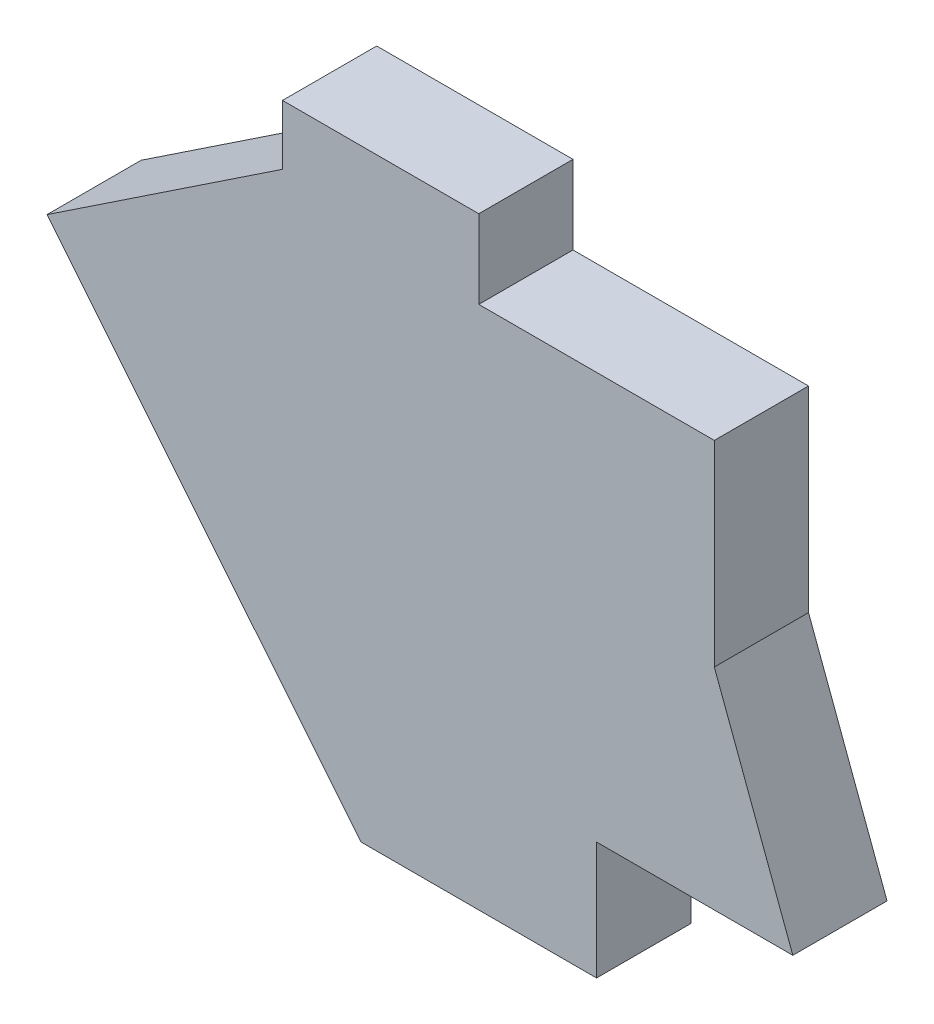
ISO-10303-21;
HEADER;
FILE_DESCRIPTION(('STEP AP214'),'2;1');
FILE_NAME('part.step','',(''),(''),'','','');
FILE_SCHEMA(('AUTOMOTIVE_DESIGN { 1 0 10303 214 1 1 1 1 }'));
ENDSEC;
DATA;
#1=APPLICATION_CONTEXT('core data for automotive mechanical design processes');
#2=APPLICATION_PROTOCOL_DEFINITION('international standard','automotive_design',2000,#1);
#3=PRODUCT_CONTEXT('',#1,'mechanical');
#4=PRODUCT('Part','Part','',(#3));
#5=PRODUCT_RELATED_PRODUCT_CATEGORY('part','',(#4));
#6=PRODUCT_DEFINITION_FORMATION('','',#4);
#7=PRODUCT_DEFINITION_CONTEXT('part definition',#1,'design');
#8=PRODUCT_DEFINITION('design','',#6,#7);
#9=PRODUCT_DEFINITION_SHAPE('','',#8);
#10=(LENGTH_UNIT() NAMED_UNIT(*) SI_UNIT(.MILLI.,.METRE.));
#11=(NAMED_UNIT(*) PLANE_ANGLE_UNIT() SI_UNIT($,.RADIAN.));
#12=(NAMED_UNIT(*) SI_UNIT($,.STERADIAN.) SOLID_ANGLE_UNIT());
#13=UNCERTAINTY_MEASURE_WITH_UNIT(LENGTH_MEASURE(1.E-05),#10,'distance_accuracy_value','');
#14=(GEOMETRIC_REPRESENTATION_CONTEXT(3) GLOBAL_UNCERTAINTY_ASSIGNED_CONTEXT((#13)) GLOBAL_UNIT_ASSIGNED_CONTEXT((#10,
#11,#12)) REPRESENTATION_CONTEXT('',''));
#15=CARTESIAN_POINT('',(0.,0.,0.));
#16=DIRECTION('',(0.,0.,1.));
#17=DIRECTION('',(1.,0.,0.));
#18=AXIS2_PLACEMENT_3D('',#15,#16,#17);
#19=CARTESIAN_POINT('',(-69.85,2.21879492064849,15.24));
#20=DIRECTION('',(0.554700196225229,-0.832050294337843,0.));
#21=DIRECTION('',(0.832050294337844,0.554700196225229,0.));
#22=AXIS2_PLACEMENT_3D('',#19,#20,#21);
#23=PLANE('',#22);
#24=DIRECTION('',(-0.832050294337844,-0.554700196225229,0.));
#25=VECTOR('',#24,1.);
#26=CARTESIAN_POINT('',(-69.85,2.21879492064849,0.));
#27=LINE('',#26,#25);
#28=CARTESIAN_POINT('',(-31.75,27.6187949206485,0.));
#29=VERTEX_POINT('',#28);
#30=CARTESIAN_POINT('',(-69.85,2.21879492064849,0.));
#31=VERTEX_POINT('',#30);
#32=EDGE_CURVE('E158',#29,#31,#27,.T.);
#33=ORIENTED_EDGE('',*,*,#32,.T.);
#34=DIRECTION('',(0.,0.,-1.));
#35=VECTOR('',#34,1.);
#36=CARTESIAN_POINT('',(-69.85,2.21879492064849,15.24));
#37=LINE('',#36,#35);
#38=CARTESIAN_POINT('',(-69.85,2.21879492064849,15.24));
#39=VERTEX_POINT('',#38);
#40=EDGE_CURVE('E11',#39,#31,#37,.T.);
#41=ORIENTED_EDGE('',*,*,#40,.F.);
#42=DIRECTION('',(-0.832050294337844,-0.554700196225229,0.));
#43=VECTOR('',#42,1.);
#44=CARTESIAN_POINT('',(-69.85,2.21879492064849,15.24));
#45=LINE('',#44,#43);
#46=CARTESIAN_POINT('',(-31.75,27.6187949206485,15.24));
#47=VERTEX_POINT('',#46);
#48=EDGE_CURVE('E189',#47,#39,#45,.T.);
#49=ORIENTED_EDGE('',*,*,#48,.F.);
#50=DIRECTION('',(0.,0.,-1.));
#51=VECTOR('',#50,1.);
#52=CARTESIAN_POINT('',(-31.75,27.6187949206485,15.24));
#53=LINE('',#52,#51);
#54=EDGE_CURVE('E154',#47,#29,#53,.T.);
#55=ORIENTED_EDGE('',*,*,#54,.T.);
#56=EDGE_LOOP('',(#33,#41,#49,#55));
#57=FACE_BOUND('',#56,.T.);
#58=ADVANCED_FACE('F39',(#57),#23,.F.);
#59=CARTESIAN_POINT('',(-19.0499999999999,-60.2652050793515,15.24));
#60=DIRECTION('',(0.775921003990177,0.630830084544861,0.));
#61=DIRECTION('',(-0.630830084544861,0.775921003990177,0.));
#62=AXIS2_PLACEMENT_3D('',#59,#60,#61);
#63=PLANE('',#62);
#64=DIRECTION('',(0.630830084544861,-0.775921003990177,0.));
#65=VECTOR('',#64,1.);
#66=CARTESIAN_POINT('',(-19.0499999999999,-60.2652050793515,0.));
#67=LINE('',#66,#65);
#68=CARTESIAN_POINT('',(-19.0499999999999,-60.2652050793515,0.));
#69=VERTEX_POINT('',#68);
#70=EDGE_CURVE('E162',#31,#69,#67,.T.);
#71=ORIENTED_EDGE('',*,*,#70,.T.);
#72=DIRECTION('',(0.,0.,-1.));
#73=VECTOR('',#72,1.);
#74=CARTESIAN_POINT('',(-19.0499999999999,-60.2652050793515,15.24));
#75=LINE('',#74,#73);
#76=CARTESIAN_POINT('',(-19.0499999999999,-60.2652050793515,15.24));
#77=VERTEX_POINT('',#76);
#78=EDGE_CURVE('E48',#77,#69,#75,.T.);
#79=ORIENTED_EDGE('',*,*,#78,.F.);
#80=DIRECTION('',(0.630830084544861,-0.775921003990177,0.));
#81=VECTOR('',#80,1.);
#82=CARTESIAN_POINT('',(-19.0499999999999,-60.2652050793515,15.24));
#83=LINE('',#82,#81);
#84=EDGE_CURVE('E108',#39,#77,#83,.T.);
#85=ORIENTED_EDGE('',*,*,#84,.F.);
#86=ORIENTED_EDGE('',*,*,#40,.T.);
#87=EDGE_LOOP('',(#71,#79,#85,#86));
#88=FACE_BOUND('',#87,.T.);
#89=ADVANCED_FACE('F275',(#88),#63,.F.);
#90=CARTESIAN_POINT('',(19.0500000000001,-60.2652050793515,15.24));
#91=DIRECTION('',(0.,1.,0.));
#92=DIRECTION('',(-1.,0.,0.));
#93=AXIS2_PLACEMENT_3D('',#90,#91,#92);
#94=PLANE('',#93);
#95=DIRECTION('',(1.,0.,0.));
#96=VECTOR('',#95,1.);
#97=CARTESIAN_POINT('',(19.0500000000001,-60.2652050793515,0.));
#98=LINE('',#97,#96);
#99=CARTESIAN_POINT('',(19.0500000000001,-60.2652050793515,0.));
#100=VERTEX_POINT('',#99);
#101=EDGE_CURVE('E165',#69,#100,#98,.T.);
#102=ORIENTED_EDGE('',*,*,#101,.T.);
#103=DIRECTION('',(0.,0.,-1.));
#104=VECTOR('',#103,1.);
#105=CARTESIAN_POINT('',(19.0500000000001,-60.2652050793515,15.24));
#106=LINE('',#105,#104);
#107=CARTESIAN_POINT('',(19.0500000000001,-60.2652050793515,15.24));
#108=VERTEX_POINT('',#107);
#109=EDGE_CURVE('E212',#108,#100,#106,.T.);
#110=ORIENTED_EDGE('',*,*,#109,.F.);
#111=DIRECTION('',(1.,0.,0.));
#112=VECTOR('',#111,1.);
#113=CARTESIAN_POINT('',(19.0500000000001,-60.2652050793515,15.24));
#114=LINE('',#113,#112);
#115=EDGE_CURVE('E222',#77,#108,#114,.T.);
#116=ORIENTED_EDGE('',*,*,#115,.F.);
#117=ORIENTED_EDGE('',*,*,#78,.T.);
#118=EDGE_LOOP('',(#102,#110,#116,#117));
#119=FACE_BOUND('',#118,.T.);
#120=ADVANCED_FACE('F220',(#119),#94,.F.);
#121=CARTESIAN_POINT('',(19.0500000000001,-41.2152050793515,15.24));
#122=DIRECTION('',(-1.,0.,0.));
#123=DIRECTION('',(0.,0.,1.));
#124=AXIS2_PLACEMENT_3D('',#121,#122,#123);
#125=PLANE('',#124);
#126=DIRECTION('',(0.,1.,0.));
#127=VECTOR('',#126,1.);
#128=CARTESIAN_POINT('',(19.0500000000001,-41.2152050793515,0.));
#129=LINE('',#128,#127);
#130=CARTESIAN_POINT('',(19.0500000000001,-41.2152050793515,0.));
#131=VERTEX_POINT('',#130);
#132=EDGE_CURVE('E168',#100,#131,#129,.T.);
#133=ORIENTED_EDGE('',*,*,#132,.T.);
#134=DIRECTION('',(0.,0.,-1.));
#135=VECTOR('',#134,1.);
#136=CARTESIAN_POINT('',(19.0500000000001,-41.2152050793515,15.24));
#137=LINE('',#136,#135);
#138=CARTESIAN_POINT('',(19.0500000000001,-41.2152050793515,15.24));
#139=VERTEX_POINT('',#138);
#140=EDGE_CURVE('E208',#139,#131,#137,.T.);
#141=ORIENTED_EDGE('',*,*,#140,.F.);
#142=DIRECTION('',(0.,1.,0.));
#143=VECTOR('',#142,1.);
#144=CARTESIAN_POINT('',(19.0500000000001,-41.2152050793515,15.24));
#145=LINE('',#144,#143);
#146=EDGE_CURVE('E241',#108,#139,#145,.T.);
#147=ORIENTED_EDGE('',*,*,#146,.F.);
#148=ORIENTED_EDGE('',*,*,#109,.T.);
#149=EDGE_LOOP('',(#133,#141,#147,#148));
#150=FACE_BOUND('',#149,.T.);
#151=ADVANCED_FACE('F231',(#150),#125,.F.);
#152=CARTESIAN_POINT('',(50.8,-41.2152050793515,15.24));
#153=DIRECTION('',(0.,1.,0.));
#154=DIRECTION('',(-1.,0.,0.));
#155=AXIS2_PLACEMENT_3D('',#152,#153,#154);
#156=PLANE('',#155);
#157=DIRECTION('',(1.,0.,0.));
#158=VECTOR('',#157,1.);
#159=CARTESIAN_POINT('',(50.8,-41.2152050793515,0.));
#160=LINE('',#159,#158);
#161=CARTESIAN_POINT('',(50.8,-41.2152050793515,0.));
#162=VERTEX_POINT('',#161);
#163=EDGE_CURVE('E171',#131,#162,#160,.T.);
#164=ORIENTED_EDGE('',*,*,#163,.T.);
#165=DIRECTION('',(0.,0.,-1.));
#166=VECTOR('',#165,1.);
#167=CARTESIAN_POINT('',(50.8,-41.2152050793515,15.24));
#168=LINE('',#167,#166);
#169=CARTESIAN_POINT('',(50.8,-41.2152050793515,15.24));
#170=VERTEX_POINT('',#169);
#171=EDGE_CURVE('E204',#170,#162,#168,.T.);
#172=ORIENTED_EDGE('',*,*,#171,.F.);
#173=DIRECTION('',(1.,0.,0.));
#174=VECTOR('',#173,1.);
#175=CARTESIAN_POINT('',(50.8,-41.2152050793515,15.24));
#176=LINE('',#175,#174);
#177=EDGE_CURVE('E237',#139,#170,#176,.T.);
#178=ORIENTED_EDGE('',*,*,#177,.F.);
#179=ORIENTED_EDGE('',*,*,#140,.T.);
#180=EDGE_LOOP('',(#164,#172,#178,#179));
#181=FACE_BOUND('',#180,.T.);
#182=ADVANCED_FACE('F235',(#181),#156,.F.);
#183=CARTESIAN_POINT('',(38.1,-7.17920507935148,15.24));
#184=DIRECTION('',(-0.936902592865339,-0.349590519725872,0.));
#185=DIRECTION('',(0.349590519725872,-0.936902592865339,0.));
#186=AXIS2_PLACEMENT_3D('',#183,#184,#185);
#187=PLANE('',#186);
#188=DIRECTION('',(-0.349590519725872,0.936902592865339,0.));
#189=VECTOR('',#188,1.);
#190=CARTESIAN_POINT('',(38.1,-7.17920507935148,0.));
#191=LINE('',#190,#189);
#192=CARTESIAN_POINT('',(38.1,-7.17920507935148,0.));
#193=VERTEX_POINT('',#192);
#194=EDGE_CURVE('E174',#162,#193,#191,.T.);
#195=ORIENTED_EDGE('',*,*,#194,.T.);
#196=DIRECTION('',(0.,0.,-1.));
#197=VECTOR('',#196,1.);
#198=CARTESIAN_POINT('',(38.1,-7.17920507935148,15.24));
#199=LINE('',#198,#197);
#200=CARTESIAN_POINT('',(38.1,-7.17920507935148,15.24));
#201=VERTEX_POINT('',#200);
#202=EDGE_CURVE('E200',#201,#193,#199,.T.);
#203=ORIENTED_EDGE('',*,*,#202,.F.);
#204=DIRECTION('',(-0.349590519725872,0.936902592865339,0.));
#205=VECTOR('',#204,1.);
#206=CARTESIAN_POINT('',(38.1,-7.17920507935148,15.24));
#207=LINE('',#206,#205);
#208=EDGE_CURVE('E240',#170,#201,#207,.T.);
#209=ORIENTED_EDGE('',*,*,#208,.F.);
#210=ORIENTED_EDGE('',*,*,#171,.T.);
#211=EDGE_LOOP('',(#195,#203,#209,#210));
#212=FACE_BOUND('',#211,.T.);
#213=ADVANCED_FACE('F288',(#212),#187,.F.);
#214=CARTESIAN_POINT('',(38.1,24.5707949206485,15.24));
#215=DIRECTION('',(-1.,0.,0.));
#216=DIRECTION('',(0.,0.,1.));
#217=AXIS2_PLACEMENT_3D('',#214,#215,#216);
#218=PLANE('',#217);
#219=DIRECTION('',(0.,1.,0.));
#220=VECTOR('',#219,1.);
#221=CARTESIAN_POINT('',(38.1,24.5707949206485,0.));
#222=LINE('',#221,#220);
#223=CARTESIAN_POINT('',(38.1,24.5707949206485,0.));
#224=VERTEX_POINT('',#223);
#225=EDGE_CURVE('E177',#193,#224,#222,.T.);
#226=ORIENTED_EDGE('',*,*,#225,.T.);
#227=DIRECTION('',(0.,0.,-1.));
#228=VECTOR('',#227,1.);
#229=CARTESIAN_POINT('',(38.1,24.5707949206485,15.24));
#230=LINE('',#229,#228);
#231=CARTESIAN_POINT('',(38.1,24.5707949206485,15.24));
#232=VERTEX_POINT('',#231);
#233=EDGE_CURVE('E196',#232,#224,#230,.T.);
#234=ORIENTED_EDGE('',*,*,#233,.F.);
#235=DIRECTION('',(0.,1.,0.));
#236=VECTOR('',#235,1.);
#237=CARTESIAN_POINT('',(38.1,24.5707949206485,15.24));
#238=LINE('',#237,#236);
#239=EDGE_CURVE('E245',#201,#232,#238,.T.);
#240=ORIENTED_EDGE('',*,*,#239,.F.);
#241=ORIENTED_EDGE('',*,*,#202,.T.);
#242=EDGE_LOOP('',(#226,#234,#240,#241));
#243=FACE_BOUND('',#242,.T.);
#244=ADVANCED_FACE('F256',(#243),#218,.F.);
#245=CARTESIAN_POINT('',(0.,24.5707949206485,15.24));
#246=DIRECTION('',(0.,-1.,0.));
#247=DIRECTION('',(1.,0.,0.));
#248=AXIS2_PLACEMENT_3D('',#245,#246,#247);
#249=PLANE('',#248);
#250=DIRECTION('',(-1.,0.,0.));
#251=VECTOR('',#250,1.);
#252=CARTESIAN_POINT('',(0.,24.5707949206485,0.));
#253=LINE('',#252,#251);
#254=CARTESIAN_POINT('',(0.,24.5707949206485,0.));
#255=VERTEX_POINT('',#254);
#256=EDGE_CURVE('E180',#224,#255,#253,.T.);
#257=ORIENTED_EDGE('',*,*,#256,.T.);
#258=DIRECTION('',(0.,0.,-1.));
#259=VECTOR('',#258,1.);
#260=CARTESIAN_POINT('',(0.,24.5707949206485,15.24));
#261=LINE('',#260,#259);
#262=CARTESIAN_POINT('',(0.,24.5707949206485,15.24));
#263=VERTEX_POINT('',#262);
#264=EDGE_CURVE('E147',#263,#255,#261,.T.);
#265=ORIENTED_EDGE('',*,*,#264,.F.);
#266=DIRECTION('',(-1.,0.,0.));
#267=VECTOR('',#266,1.);
#268=CARTESIAN_POINT('',(0.,24.5707949206485,15.24));
#269=LINE('',#268,#267);
#270=EDGE_CURVE('E136',#232,#263,#269,.T.);
#271=ORIENTED_EDGE('',*,*,#270,.F.);
#272=ORIENTED_EDGE('',*,*,#233,.T.);
#273=EDGE_LOOP('',(#257,#265,#271,#272));
#274=FACE_BOUND('',#273,.T.);
#275=ADVANCED_FACE('F260',(#274),#249,.F.);
#276=CARTESIAN_POINT('',(0.,37.2707949206485,15.24));
#277=DIRECTION('',(-1.,0.,0.));
#278=DIRECTION('',(0.,-1.,0.));
#279=AXIS2_PLACEMENT_3D('',#276,#277,#278);
#280=PLANE('',#279);
#281=DIRECTION('',(0.,1.,0.));
#282=VECTOR('',#281,1.);
#283=CARTESIAN_POINT('',(0.,37.2707949206485,0.));
#284=LINE('',#283,#282);
#285=CARTESIAN_POINT('',(0.,37.2707949206485,0.));
#286=VERTEX_POINT('',#285);
#287=EDGE_CURVE('E145',#255,#286,#284,.T.);
#288=ORIENTED_EDGE('',*,*,#287,.T.);
#289=DIRECTION('',(0.,0.,-1.));
#290=VECTOR('',#289,1.);
#291=CARTESIAN_POINT('',(0.,37.2707949206485,15.24));
#292=LINE('',#291,#290);
#293=CARTESIAN_POINT('',(0.,37.2707949206485,15.24));
#294=VERTEX_POINT('',#293);
#295=EDGE_CURVE('E142',#294,#286,#292,.T.);
#296=ORIENTED_EDGE('',*,*,#295,.F.);
#297=DIRECTION('',(0.,1.,0.));
#298=VECTOR('',#297,1.);
#299=CARTESIAN_POINT('',(0.,37.2707949206485,15.24));
#300=LINE('',#299,#298);
#301=EDGE_CURVE('E130',#263,#294,#300,.T.);
#302=ORIENTED_EDGE('',*,*,#301,.F.);
#303=ORIENTED_EDGE('',*,*,#264,.T.);
#304=EDGE_LOOP('',(#288,#296,#302,#303));
#305=FACE_BOUND('',#304,.T.);
#306=ADVANCED_FACE('F143',(#305),#280,.F.);
#307=CARTESIAN_POINT('',(-31.75,37.2707949206485,15.24));
#308=DIRECTION('',(0.,-1.,0.));
#309=DIRECTION('',(0.,0.,-1.));
#310=AXIS2_PLACEMENT_3D('',#307,#308,#309);
#311=PLANE('',#310);
#312=DIRECTION('',(-1.,0.,0.));
#313=VECTOR('',#312,1.);
#314=CARTESIAN_POINT('',(-31.75,37.2707949206485,0.));
#315=LINE('',#314,#313);
#316=CARTESIAN_POINT('',(-31.75,37.2707949206485,0.));
#317=VERTEX_POINT('',#316);
#318=EDGE_CURVE('E94',#286,#317,#315,.T.);
#319=ORIENTED_EDGE('',*,*,#318,.T.);
#320=DIRECTION('',(0.,0.,-1.));
#321=VECTOR('',#320,1.);
#322=CARTESIAN_POINT('',(-31.75,37.2707949206485,15.24));
#323=LINE('',#322,#321);
#324=CARTESIAN_POINT('',(-31.75,37.2707949206485,15.24));
#325=VERTEX_POINT('',#324);
#326=EDGE_CURVE('E148',#325,#317,#323,.T.);
#327=ORIENTED_EDGE('',*,*,#326,.F.);
#328=DIRECTION('',(-1.,0.,0.));
#329=VECTOR('',#328,1.);
#330=CARTESIAN_POINT('',(-31.75,37.2707949206485,15.24));
#331=LINE('',#330,#329);
#332=EDGE_CURVE('E134',#294,#325,#331,.T.);
#333=ORIENTED_EDGE('',*,*,#332,.F.);
#334=ORIENTED_EDGE('',*,*,#295,.T.);
#335=EDGE_LOOP('',(#319,#327,#333,#334));
#336=FACE_BOUND('',#335,.T.);
#337=ADVANCED_FACE('F150',(#336),#311,.F.);
#338=CARTESIAN_POINT('',(-31.75,27.6187949206485,15.24));
#339=DIRECTION('',(1.,0.,0.));
#340=DIRECTION('',(0.,0.,-1.));
#341=AXIS2_PLACEMENT_3D('',#338,#339,#340);
#342=PLANE('',#341);
#343=DIRECTION('',(0.,-1.,0.));
#344=VECTOR('',#343,1.);
#345=CARTESIAN_POINT('',(-31.75,27.6187949206485,0.));
#346=LINE('',#345,#344);
#347=EDGE_CURVE('E100',#317,#29,#346,.T.);
#348=ORIENTED_EDGE('',*,*,#347,.T.);
#349=ORIENTED_EDGE('',*,*,#54,.F.);
#350=DIRECTION('',(0.,-1.,0.));
#351=VECTOR('',#350,1.);
#352=CARTESIAN_POINT('',(-31.75,27.6187949206485,15.24));
#353=LINE('',#352,#351);
#354=EDGE_CURVE('E56',#325,#47,#353,.T.);
#355=ORIENTED_EDGE('',*,*,#354,.F.);
#356=ORIENTED_EDGE('',*,*,#326,.T.);
#357=EDGE_LOOP('',(#348,#349,#355,#356));
#358=FACE_BOUND('',#357,.T.);
#359=ADVANCED_FACE('F264',(#358),#342,.F.);
#360=CARTESIAN_POINT('',(0.,0.,15.24));
#361=DIRECTION('',(0.,0.,1.));
#362=DIRECTION('',(1.,0.,0.));
#363=AXIS2_PLACEMENT_3D('',#360,#361,#362);
#364=PLANE('',#363);
#365=ORIENTED_EDGE('',*,*,#48,.T.);
#366=ORIENTED_EDGE('',*,*,#84,.T.);
#367=ORIENTED_EDGE('',*,*,#115,.T.);
#368=ORIENTED_EDGE('',*,*,#146,.T.);
#369=ORIENTED_EDGE('',*,*,#177,.T.);
#370=ORIENTED_EDGE('',*,*,#208,.T.);
#371=ORIENTED_EDGE('',*,*,#239,.T.);
#372=ORIENTED_EDGE('',*,*,#270,.T.);
#373=ORIENTED_EDGE('',*,*,#301,.T.);
#374=ORIENTED_EDGE('',*,*,#332,.T.);
#375=ORIENTED_EDGE('',*,*,#354,.T.);
#376=EDGE_LOOP('',(#365,#366,#367,#368,#369,#370,#371,#372,#373,#374,#375));
#377=FACE_BOUND('',#376,.T.);
#378=ADVANCED_FACE('F132',(#377),#364,.T.);
#379=CARTESIAN_POINT('',(0.,0.,0.));
#380=DIRECTION('',(0.,0.,1.));
#381=DIRECTION('',(1.,0.,0.));
#382=AXIS2_PLACEMENT_3D('',#379,#380,#381);
#383=PLANE('',#382);
#384=ORIENTED_EDGE('',*,*,#32,.F.);
#385=ORIENTED_EDGE('',*,*,#347,.F.);
#386=ORIENTED_EDGE('',*,*,#318,.F.);
#387=ORIENTED_EDGE('',*,*,#287,.F.);
#388=ORIENTED_EDGE('',*,*,#256,.F.);
#389=ORIENTED_EDGE('',*,*,#225,.F.);
#390=ORIENTED_EDGE('',*,*,#194,.F.);
#391=ORIENTED_EDGE('',*,*,#163,.F.);
#392=ORIENTED_EDGE('',*,*,#132,.F.);
#393=ORIENTED_EDGE('',*,*,#101,.F.);
#394=ORIENTED_EDGE('',*,*,#70,.F.);
#395=EDGE_LOOP('',(#384,#385,#386,#387,#388,#389,#390,#391,#392,#393,#394));
#396=FACE_BOUND('',#395,.T.);
#397=ADVANCED_FACE('F226',(#396),#383,.F.);
#398=CLOSED_SHELL('',(#58,#89,#120,#151,#182,#213,#244,#275,#306,#337,#359,#378,#397));
#399=MANIFOLD_SOLID_BREP('B2',#398);
#400=ADVANCED_BREP_SHAPE_REPRESENTATION('',(#18,#399),#14);
#401=SHAPE_DEFINITION_REPRESENTATION(#9,#400);
ENDSEC;
END-ISO-10303-21;
